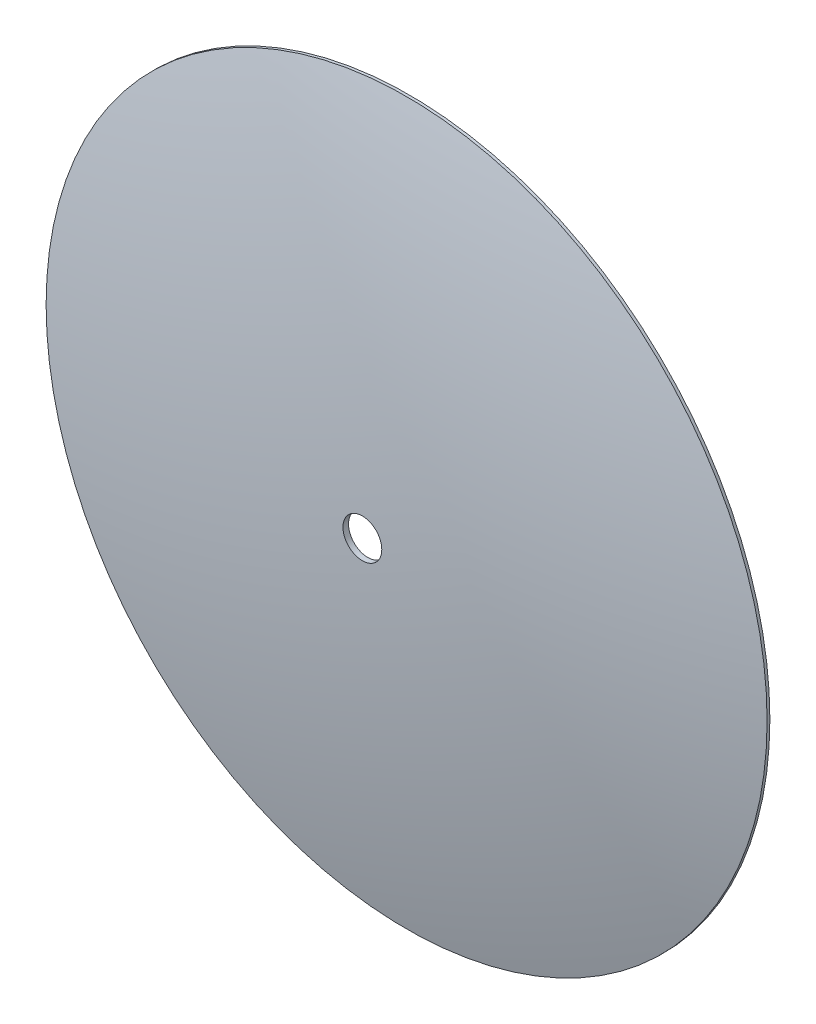
ISO-10303-21;
HEADER;
FILE_DESCRIPTION(('STEP AP214'),'2;1');
FILE_NAME('part.step','',(''),(''),'','','');
FILE_SCHEMA(('AUTOMOTIVE_DESIGN { 1 0 10303 214 1 1 1 1 }'));
ENDSEC;
DATA;
#1=APPLICATION_CONTEXT('core data for automotive mechanical design processes');
#2=APPLICATION_PROTOCOL_DEFINITION('international standard','automotive_design',2000,#1);
#3=PRODUCT_CONTEXT('',#1,'mechanical');
#4=PRODUCT('Part','Part','',(#3));
#5=PRODUCT_RELATED_PRODUCT_CATEGORY('part','',(#4));
#6=PRODUCT_DEFINITION_FORMATION('','',#4);
#7=PRODUCT_DEFINITION_CONTEXT('part definition',#1,'design');
#8=PRODUCT_DEFINITION('design','',#6,#7);
#9=PRODUCT_DEFINITION_SHAPE('','',#8);
#10=(LENGTH_UNIT() NAMED_UNIT(*) SI_UNIT(.MILLI.,.METRE.));
#11=(NAMED_UNIT(*) PLANE_ANGLE_UNIT() SI_UNIT($,.RADIAN.));
#12=(NAMED_UNIT(*) SI_UNIT($,.STERADIAN.) SOLID_ANGLE_UNIT());
#13=UNCERTAINTY_MEASURE_WITH_UNIT(LENGTH_MEASURE(1.E-05),#10,'distance_accuracy_value','');
#14=(GEOMETRIC_REPRESENTATION_CONTEXT(3) GLOBAL_UNCERTAINTY_ASSIGNED_CONTEXT((#13)) GLOBAL_UNIT_ASSIGNED_CONTEXT((#10,
#11,#12)) REPRESENTATION_CONTEXT('',''));
#15=CARTESIAN_POINT('',(0.,0.,0.));
#16=DIRECTION('',(0.,0.,1.));
#17=DIRECTION('',(1.,0.,0.));
#18=AXIS2_PLACEMENT_3D('',#15,#16,#17);
#19=CARTESIAN_POINT('',(0.,0.,-659.28875));
#20=DIRECTION('',(0.,0.,1.));
#21=DIRECTION('',(1.,0.,0.));
#22=AXIS2_PLACEMENT_3D('',#19,#20,#21);
#23=SPHERICAL_SURFACE('',#22,680.87875);
#24=CARTESIAN_POINT('',(0.,0.,1.27));
#25=DIRECTION('',(0.,0.,1.));
#26=DIRECTION('',(1.,0.,0.));
#27=AXIS2_PLACEMENT_3D('',#24,#25,#26);
#28=CIRCLE('',#27,165.1);
#29=CARTESIAN_POINT('',(165.1,0.,1.26999999999999));
#30=VERTEX_POINT('',#29);
#31=EDGE_CURVE('E10',#30,#30,#28,.T.);
#32=CARTESIAN_POINT('',(0.,0.,21.5319606878892));
#33=DIRECTION('',(0.,0.,-1.));
#34=DIRECTION('',(-1.,0.,0.));
#35=AXIS2_PLACEMENT_3D('',#32,#33,#34);
#36=CIRCLE('',#35,8.89);
#37=CARTESIAN_POINT('',(8.88999999999211,0.,21.5319606878892));
#38=VERTEX_POINT('',#37);
#39=EDGE_CURVE('E51',#38,#38,#36,.F.);
#40=CARTESIAN_POINT('',(165.1,0.,1.26999999999999));
#41=CARTESIAN_POINT('',(163.504578024239,0.,1.66875975404025));
#42=CARTESIAN_POINT('',(161.907711333227,0.,2.0617392521102));
#43=CARTESIAN_POINT('',(158.71117247421,0.,2.83611758394471));
#44=CARTESIAN_POINT('',(157.111500306206,0.,3.21751641770926));
#45=CARTESIAN_POINT('',(153.909434446716,0.,3.96871326856822));
#46=CARTESIAN_POINT('',(152.30704075523,0.,4.33851128566261));
#47=CARTESIAN_POINT('',(149.09961598464,0.,5.06648712278549));
#48=CARTESIAN_POINT('',(147.494584905535,0.,5.42466494281397));
#49=CARTESIAN_POINT('',(144.281969623457,0.,6.12938157183067));
#50=CARTESIAN_POINT('',(142.674385420484,0.,6.47592038081888));
#51=CARTESIAN_POINT('',(139.456748291298,0.,7.15734079653887));
#52=CARTESIAN_POINT('',(137.846695365084,0.,7.49222240327065));
#53=CARTESIAN_POINT('',(134.624205318896,0.,8.150310832144));
#54=CARTESIAN_POINT('',(133.011768198921,0.,8.47351765428557));
#55=CARTESIAN_POINT('',(129.784594420065,0.,9.10823954542432));
#56=CARTESIAN_POINT('',(128.169857761184,0.,9.41975461442149));
#57=CARTESIAN_POINT('',(124.938169680045,0.,10.0310766443228));
#58=CARTESIAN_POINT('',(123.321218257787,0.,10.3308836052268));
#59=CARTESIAN_POINT('',(120.085185541716,0.,10.9187736787427));
#60=CARTESIAN_POINT('',(118.466104247903,0.,11.2068567913545));
#61=CARTESIAN_POINT('',(115.22589679236,0.,11.771284043586));
#62=CARTESIAN_POINT('',(113.60477063063,0.,12.0476281832057));
#63=CARTESIAN_POINT('',(110.36055855025,0.,12.5885629810671));
#64=CARTESIAN_POINT('',(108.7374726316,0.,12.8531536393088));
#65=CARTESIAN_POINT('',(105.489426251268,0.,13.3705675830989));
#66=CARTESIAN_POINT('',(103.864465789585,0.,13.6233908686472));
#67=CARTESIAN_POINT('',(100.612755635489,0.,14.1172567935357));
#68=CARTESIAN_POINT('',(98.9860059430749,0.,14.3582994328759));
#69=CARTESIAN_POINT('',(95.7308027337559,0.,14.828591410331));
#70=CARTESIAN_POINT('',(94.1023492168505,0.,15.0578407484458));
#71=CARTESIAN_POINT('',(90.8438238542395,0.,15.5045340875951));
#72=CARTESIAN_POINT('',(89.2137520085339,0.,15.7219780886296));
#73=CARTESIAN_POINT('',(85.9520755689784,0.,16.1450493375567));
#74=CARTESIAN_POINT('',(84.3204709751286,0.,16.3506765854491));
#75=CARTESIAN_POINT('',(81.0558147004115,0.,16.7501035324242));
#76=CARTESIAN_POINT('',(79.4227630195442,0.,16.9439032315067));
#77=CARTESIAN_POINT('',(76.155298307893,0.,17.3196649061537));
#78=CARTESIAN_POINT('',(74.520885277109,0.,17.5016268817181));
#79=CARTESIAN_POINT('',(71.2507836741973,0.,17.8537035561146));
#80=CARTESIAN_POINT('',(69.6150951020696,0.,18.0238182549467));
#81=CARTESIAN_POINT('',(66.342528292011,0.,18.3521914446604));
#82=CARTESIAN_POINT('',(64.7056500540801,0.,18.510449935542));
#83=CARTESIAN_POINT('',(61.4307898504145,0.,18.8151024006011));
#84=CARTESIAN_POINT('',(59.7928078846797,0.,18.9614963747788));
#85=CARTESIAN_POINT('',(56.5158262213526,0.,19.2424121205762));
#86=CARTESIAN_POINT('',(54.8768265237602,0.,19.3769338921959));
#87=CARTESIAN_POINT('',(51.5978954460962,0.,19.6340981703328));
#88=CARTESIAN_POINT('',(49.9579640660247,0.,19.7567406768499));
#89=CARTESIAN_POINT('',(46.6772557216949,0.,19.9901399858949));
#90=CARTESIAN_POINT('',(45.0364787574367,0.,20.1008967884227));
#91=CARTESIAN_POINT('',(41.7541653874216,0.,20.3105188746781));
#92=CARTESIAN_POINT('',(40.1126289816647,0.,20.4093841584056));
#93=CARTESIAN_POINT('',(36.8288829112069,0.,20.5952180163359));
#94=CARTESIAN_POINT('',(35.1866732465061,0.,20.6821865905387));
#95=CARTESIAN_POINT('',(31.9016668760797,0.,20.8442224641504));
#96=CARTESIAN_POINT('',(30.2588701703543,0.,20.9192897635593));
#97=CARTESIAN_POINT('',(26.9727759665526,0.,21.0575191439204));
#98=CARTESIAN_POINT('',(25.3294784684764,0.,21.1206812248726));
#99=CARTESIAN_POINT('',(22.042468955184,0.,21.2350968617278));
#100=CARTESIAN_POINT('',(20.3987569399678,0.,21.2863504176308));
#101=CARTESIAN_POINT('',(17.1110046884566,0.,21.3769462781004));
#102=CARTESIAN_POINT('',(15.4669644521617,0.,21.4162885826672));
#103=CARTESIAN_POINT('',(12.1786420751896,0.,21.4830600071223));
#104=CARTESIAN_POINT('',(10.5343599345123,0.,21.5104891270108));
#105=CARTESIAN_POINT('',(8.88999999999211,0.,21.5319606878892));
#106=B_SPLINE_CURVE_WITH_KNOTS('',3,(#40,#41,#42,#43,#44,#45,#46,#47,#48,#49,#50,#51,#52,#53,
#54,#55,#56,#57,#58,#59,#60,#61,#62,#63,#64,#65,#66,#67,#68,#69,#70,#71,#72,#73,#74,#75,#76,#77,
#78,#79,#80,#81,#82,#83,#84,#85,#86,#87,#88,#89,#90,#91,#92,#93,#94,#95,#96,#97,#98,#99,#100,
#101,#102,#103,#104,#105),.UNSPECIFIED.,.F.,.F.,(4,2,2,2,2,2,2,2,2,2,2,2,2,2,2,2,2,2,2,2,2,2,2,
2,2,2,2,2,2,2,2,2,4),(0.,4.9334895448029,9.86697908960563,14.8004686344085,19.7339581792114,
24.6674477240142,29.6009372688171,34.53442681362,39.4679163584228,44.4014059032256,
49.3348954480285,54.2683849928314,59.2018745376341,64.135364082437,69.0688536272399,
74.0023431720426,78.9358327168455,83.8693222616484,88.8028118064511,93.7363013512541,
98.6697908960569,103.60328044086,108.536769985663,113.470259530465,118.403749075268,
123.337238620071,128.270728164874,133.204217709677,138.13770725448,143.071196799283,
148.004686344085,152.938175888888,157.871665433691),.UNSPECIFIED.);
#107=EDGE_CURVE('BSEAM37',#30,#38,#106,.T.);
#108=ORIENTED_EDGE('',*,*,#31,.T.);
#109=ORIENTED_EDGE('',*,*,#39,.F.);
#110=ORIENTED_EDGE('',*,*,#107,.T.);
#111=ORIENTED_EDGE('',*,*,#107,.F.);
#112=EDGE_LOOP('',(#108,#110,#109,#111));
#113=FACE_BOUND('',#112,.T.);
#114=ADVANCED_FACE('F37',(#113),#23,.T.);
#115=CARTESIAN_POINT('',(0.,0.,-659.28875));
#116=DIRECTION('',(0.,0.,1.));
#117=DIRECTION('',(1.,0.,0.));
#118=AXIS2_PLACEMENT_3D('',#115,#116,#117);
#119=SPHERICAL_SURFACE('',#118,678.33875);
#120=CARTESIAN_POINT('',(0.,0.,0.));
#121=DIRECTION('',(0.,0.,1.));
#122=DIRECTION('',(1.,0.,0.));
#123=AXIS2_PLACEMENT_3D('',#120,#121,#122);
#124=CIRCLE('',#123,159.630209781858);
#125=CARTESIAN_POINT('',(159.630209781858,0.,-1.11022302462516E-13));
#126=VERTEX_POINT('',#125);
#127=EDGE_CURVE('E47',#126,#126,#124,.F.);
#128=CARTESIAN_POINT('',(0.,0.,18.9917433444294));
#129=DIRECTION('',(0.,0.,-1.));
#130=DIRECTION('',(-1.,0.,0.));
#131=AXIS2_PLACEMENT_3D('',#128,#129,#130);
#132=CIRCLE('',#131,8.89);
#133=CARTESIAN_POINT('',(8.8899999999937,0.,18.9917433444295));
#134=VERTEX_POINT('',#133);
#135=EDGE_CURVE('E56',#134,#134,#132,.F.);
#136=CARTESIAN_POINT('',(159.630209781858,0.,-1.11022302462516E-13));
#137=CARTESIAN_POINT('',(158.088797917462,0.,0.373214264504708));
#138=CARTESIAN_POINT('',(156.546077151143,0.,0.741022627941328));
#139=CARTESIAN_POINT('',(153.458093808453,0.,1.46580987827945));
#140=CARTESIAN_POINT('',(151.912831232081,0.,1.82278876518096));
#141=CARTESIAN_POINT('',(148.819840263073,0.,2.52589938805013));
#142=CARTESIAN_POINT('',(147.272111870436,0.,2.87203112401779));
#143=CARTESIAN_POINT('',(144.174265417503,0.,3.55343044700684));
#144=CARTESIAN_POINT('',(142.624147357206,0.,3.88869803402823));
#145=CARTESIAN_POINT('',(139.521597826136,0.,4.54835255733068));
#146=CARTESIAN_POINT('',(137.969166355365,0.,4.87273949361176));
#147=CARTESIAN_POINT('',(134.862066376748,0.,5.51061675916955));
#148=CARTESIAN_POINT('',(133.307397868903,0.,5.82410708844626));
#149=CARTESIAN_POINT('',(130.195900298951,0.,6.44017571705059));
#150=CARTESIAN_POINT('',(128.639071236843,0.,6.7427540163782));
#151=CARTESIAN_POINT('',(125.523329147637,0.,7.33698369970043));
#152=CARTESIAN_POINT('',(123.964416120539,0.,7.62863508369504));
#153=CARTESIAN_POINT('',(120.8445827931,0.,8.20099658832663));
#154=CARTESIAN_POINT('',(119.283662492759,0.,8.48170670896361));
#155=CARTESIAN_POINT('',(116.159891409344,0.,9.03217187717102));
#156=CARTESIAN_POINT('',(114.597040626271,0.,9.30192692474146));
#157=CARTESIAN_POINT('',(111.469485462868,0.,9.8304686760346));
#158=CARTESIAN_POINT('',(109.904781082539,0.,10.0892553797573));
#159=CARTESIAN_POINT('',(106.773595701294,0.,10.5958477121729));
#160=CARTESIAN_POINT('',(105.207114700378,0.,10.8436533408657));
#161=CARTESIAN_POINT('',(102.072453142026,0.,11.3282713322594));
#162=CARTESIAN_POINT('',(100.504272584592,0.,11.5650836949603));
#163=CARTESIAN_POINT('',(97.3662890608846,0.,12.027703504229));
#164=CARTESIAN_POINT('',(95.7964860946119,0.,12.2535109507968));
#165=CARTESIAN_POINT('',(92.6553349807243,0.,12.694109819053));
#166=CARTESIAN_POINT('',(91.0839868331093,0.,12.9089012407413));
#167=CARTESIAN_POINT('',(87.9398226600489,0.,13.3274574924321));
#168=CARTESIAN_POINT('',(86.3670066346035,0.,13.5312223224346));
#169=CARTESIAN_POINT('',(83.2199840816073,0.,13.9277153664082));
#170=CARTESIAN_POINT('',(81.6457775540565,0.,14.1204435803793));
#171=CARTESIAN_POINT('',(78.4960514409814,0.,14.4948539108981));
#172=CARTESIAN_POINT('',(76.9205318554571,0.,14.6765360274458));
#173=CARTESIAN_POINT('',(73.7682571351635,0.,15.0288452251458));
#174=CARTESIAN_POINT('',(72.1915020003942,0.,15.1994723062982));
#175=CARTESIAN_POINT('',(69.0368337511228,0.,15.5296630390954));
#176=CARTESIAN_POINT('',(67.4589206366207,0.,15.6892266907402));
#177=CARTESIAN_POINT('',(64.3020140543635,0.,15.9972827146829));
#178=CARTESIAN_POINT('',(62.7230205866084,0.,16.1457750869807));
#179=CARTESIAN_POINT('',(59.5640309774737,0.,16.431681247049));
#180=CARTESIAN_POINT('',(57.9840348360941,0.,16.5690950348195));
#181=CARTESIAN_POINT('',(54.823117608666,0.,16.8328372656702));
#182=CARTESIAN_POINT('',(53.2421965226175,0.,16.9591657087505));
#183=CARTESIAN_POINT('',(50.0795071803106,0.,17.2007310354123));
#184=CARTESIAN_POINT('',(48.4977389240522,0.,17.3159679189939));
#185=CARTESIAN_POINT('',(45.3334330574614,0.,17.5353444574923));
#186=CARTESIAN_POINT('',(43.750895447129,0.,17.6394841124091));
#187=CARTESIAN_POINT('',(40.5851287263758,0.,17.8366610704014));
#188=CARTESIAN_POINT('',(39.0018996159551,0.,17.9296983734769));
#189=CARTESIAN_POINT('',(35.8348277830259,0.,18.1046660505953));
#190=CARTESIAN_POINT('',(34.2509850605174,0.,18.1865964246381));
#191=CARTESIAN_POINT('',(31.0827639216153,0.,18.3393462136683));
#192=CARTESIAN_POINT('',(29.4983855052218,0.,18.4101656286556));
#193=CARTESIAN_POINT('',(26.3291709230496,0.,18.5406900133422));
#194=CARTESIAN_POINT('',(24.7443347572709,0.,18.6003949830415));
#195=CARTESIAN_POINT('',(21.5742826435592,0.,18.7086875482281));
#196=CARTESIAN_POINT('',(19.9890666956262,0.,18.7572751437154));
#197=CARTESIAN_POINT('',(16.8183330027301,0.,18.843330539198));
#198=CARTESIAN_POINT('',(15.232815257767,0.,18.8807983391934));
#199=CARTESIAN_POINT('',(12.0615559737317,0.,18.9446124160613));
#200=CARTESIAN_POINT('',(10.4758144346596,0.,18.9709586929338));
#201=CARTESIAN_POINT('',(8.8899999999937,0.,18.9917433444295));
#202=B_SPLINE_CURVE_WITH_KNOTS('',3,(#136,#137,#138,#139,#140,#141,#142,#143,#144,#145,#146,
#147,#148,#149,#150,#151,#152,#153,#154,#155,#156,#157,#158,#159,#160,#161,#162,#163,#164,#165,
#166,#167,#168,#169,#170,#171,#172,#173,#174,#175,#176,#177,#178,#179,#180,#181,#182,#183,#184,
#185,#186,#187,#188,#189,#190,#191,#192,#193,#194,#195,#196,#197,#198,#199,#200,#201),
.UNSPECIFIED.,.F.,.F.,(4,2,2,2,2,2,2,2,2,2,2,2,2,2,2,2,2,2,2,2,2,2,2,2,2,2,2,2,2,2,2,2,4),(0.,
4.75784215616161,9.51568431232323,14.2735264684848,19.0313686246464,23.7892107808081,
28.5470529369697,33.3048950931313,38.0627372492929,42.8205794054545,47.5784215616161,
52.3362637177777,57.0941058739393,61.851948030101,66.6097901862625,71.3676323424242,
76.1254744985858,80.8833166547474,85.641158810909,90.3990009670706,95.1568431232322,
99.9146852793939,104.672527435555,109.430369591717,114.188211747879,118.94605390404,
123.703896060202,128.461738216363,133.219580372525,137.977422528687,142.735264684848,
147.49310684101,152.250948997172),.UNSPECIFIED.);
#203=EDGE_CURVE('BSEAM60',#126,#134,#202,.T.);
#204=ORIENTED_EDGE('',*,*,#127,.T.);
#205=ORIENTED_EDGE('',*,*,#135,.T.);
#206=ORIENTED_EDGE('',*,*,#203,.T.);
#207=ORIENTED_EDGE('',*,*,#203,.F.);
#208=EDGE_LOOP('',(#204,#206,#205,#207));
#209=FACE_BOUND('',#208,.T.);
#210=ADVANCED_FACE('F60',(#209),#119,.F.);
#211=CARTESIAN_POINT('',(0.,0.,1.27));
#212=DIRECTION('',(0.,0.,-1.));
#213=DIRECTION('',(-1.,0.,0.));
#214=AXIS2_PLACEMENT_3D('',#211,#212,#213);
#215=CYLINDRICAL_SURFACE('',#214,165.1);
#216=ORIENTED_EDGE('',*,*,#31,.F.);
#217=EDGE_LOOP('',(#216));
#218=FACE_BOUND('',#217,.T.);
#219=CARTESIAN_POINT('',(0.,0.,0.));
#220=DIRECTION('',(0.,0.,1.));
#221=DIRECTION('',(1.,0.,0.));
#222=AXIS2_PLACEMENT_3D('',#219,#220,#221);
#223=CIRCLE('',#222,165.1);
#224=CARTESIAN_POINT('',(165.1,0.,0.));
#225=VERTEX_POINT('',#224);
#226=EDGE_CURVE('E43',#225,#225,#223,.T.);
#227=ORIENTED_EDGE('',*,*,#226,.T.);
#228=EDGE_LOOP('',(#227));
#229=FACE_BOUND('',#228,.T.);
#230=ADVANCED_FACE('F70',(#218,#229),#215,.T.);
#231=CARTESIAN_POINT('',(0.,0.,0.));
#232=DIRECTION('',(0.,0.,1.));
#233=DIRECTION('',(1.,0.,0.));
#234=AXIS2_PLACEMENT_3D('',#231,#232,#233);
#235=PLANE('',#234);
#236=ORIENTED_EDGE('',*,*,#127,.F.);
#237=EDGE_LOOP('',(#236));
#238=FACE_BOUND('',#237,.T.);
#239=ORIENTED_EDGE('',*,*,#226,.F.);
#240=EDGE_LOOP('',(#239));
#241=FACE_BOUND('',#240,.T.);
#242=ADVANCED_FACE('F64',(#238,#241),#235,.F.);
#243=CARTESIAN_POINT('',(0.,0.,21.591));
#244=DIRECTION('',(0.,0.,-1.));
#245=DIRECTION('',(-1.,0.,0.));
#246=AXIS2_PLACEMENT_3D('',#243,#244,#245);
#247=CYLINDRICAL_SURFACE('',#246,8.89);
#248=ORIENTED_EDGE('',*,*,#39,.T.);
#249=EDGE_LOOP('',(#248));
#250=FACE_BOUND('',#249,.T.);
#251=ORIENTED_EDGE('',*,*,#135,.F.);
#252=EDGE_LOOP('',(#251));
#253=FACE_BOUND('',#252,.T.);
#254=ADVANCED_FACE('F62',(#250,#253),#247,.F.);
#255=CLOSED_SHELL('',(#114,#210,#230,#242,#254));
#256=MANIFOLD_SOLID_BREP('B2',#255);
#257=ADVANCED_BREP_SHAPE_REPRESENTATION('',(#18,#256),#14);
#258=SHAPE_DEFINITION_REPRESENTATION(#9,#257);
ENDSEC;
END-ISO-10303-21;
